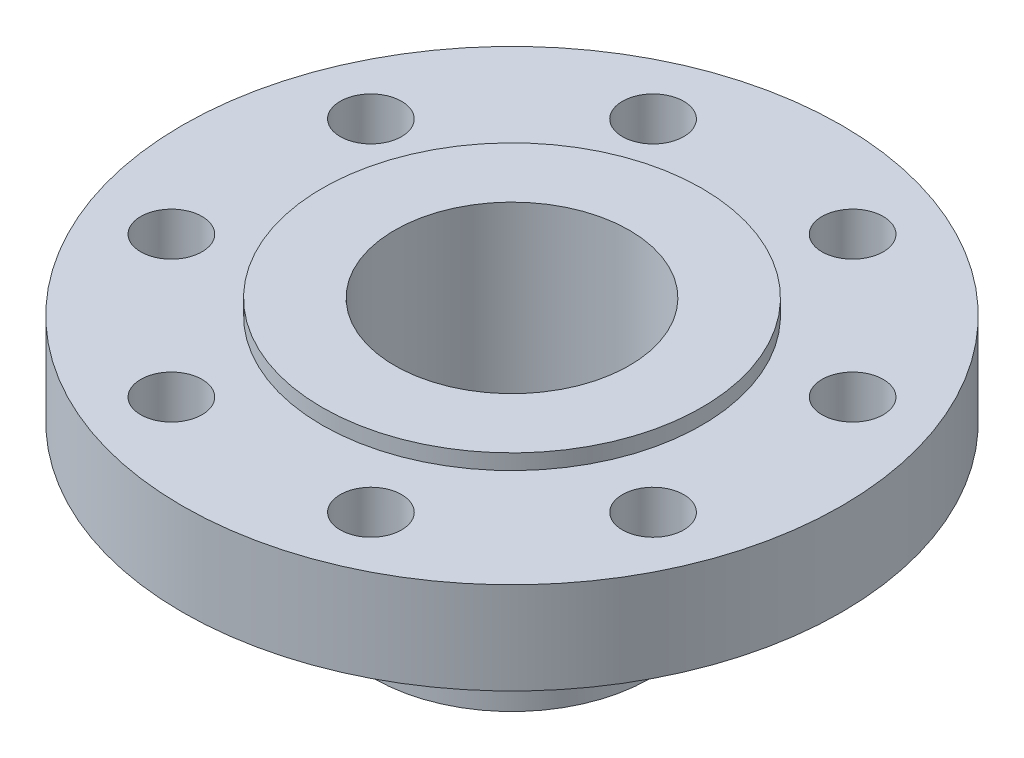
ISO-10303-21;
HEADER;
FILE_DESCRIPTION(('STEP AP214'),'2;1');
FILE_NAME('part.step','',(''),(''),'','','');
FILE_SCHEMA(('AUTOMOTIVE_DESIGN { 1 0 10303 214 1 1 1 1 }'));
ENDSEC;
DATA;
#1=APPLICATION_CONTEXT('core data for automotive mechanical design processes');
#2=APPLICATION_PROTOCOL_DEFINITION('international standard','automotive_design',2000,#1);
#3=PRODUCT_CONTEXT('',#1,'mechanical');
#4=PRODUCT('Part','Part','',(#3));
#5=PRODUCT_RELATED_PRODUCT_CATEGORY('part','',(#4));
#6=PRODUCT_DEFINITION_FORMATION('','',#4);
#7=PRODUCT_DEFINITION_CONTEXT('part definition',#1,'design');
#8=PRODUCT_DEFINITION('design','',#6,#7);
#9=PRODUCT_DEFINITION_SHAPE('','',#8);
#10=(LENGTH_UNIT() NAMED_UNIT(*) SI_UNIT(.MILLI.,.METRE.));
#11=(NAMED_UNIT(*) PLANE_ANGLE_UNIT() SI_UNIT($,.RADIAN.));
#12=(NAMED_UNIT(*) SI_UNIT($,.STERADIAN.) SOLID_ANGLE_UNIT());
#13=UNCERTAINTY_MEASURE_WITH_UNIT(LENGTH_MEASURE(1.E-05),#10,'distance_accuracy_value','');
#14=(GEOMETRIC_REPRESENTATION_CONTEXT(3) GLOBAL_UNCERTAINTY_ASSIGNED_CONTEXT((#13)) GLOBAL_UNIT_ASSIGNED_CONTEXT((#10,
#11,#12)) REPRESENTATION_CONTEXT('',''));
#15=CARTESIAN_POINT('',(0.,0.,0.));
#16=DIRECTION('',(0.,0.,1.));
#17=DIRECTION('',(1.,0.,0.));
#18=AXIS2_PLACEMENT_3D('',#15,#16,#17);
#19=CARTESIAN_POINT('',(57.15,0.,0.));
#20=DIRECTION('',(0.,-1.,0.));
#21=DIRECTION('',(0.,0.,-1.));
#22=AXIS2_PLACEMENT_3D('',#19,#20,#21);
#23=PLANE('',#22);
#24=CARTESIAN_POINT('',(0.,0.,0.));
#25=DIRECTION('',(0.,-1.,0.));
#26=DIRECTION('',(0.,0.,-1.));
#27=AXIS2_PLACEMENT_3D('',#24,#25,#26);
#28=CIRCLE('',#27,57.15);
#29=CARTESIAN_POINT('',(0.,0.,-57.15));
#30=VERTEX_POINT('',#29);
#31=EDGE_CURVE('E54',#30,#30,#28,.T.);
#32=ORIENTED_EDGE('',*,*,#31,.T.);
#33=EDGE_LOOP('',(#32));
#34=FACE_BOUND('',#33,.T.);
#35=CARTESIAN_POINT('',(0.,0.,0.));
#36=DIRECTION('',(0.,-1.,0.));
#37=DIRECTION('',(0.,0.,-1.));
#38=AXIS2_PLACEMENT_3D('',#35,#36,#37);
#39=CIRCLE('',#38,48.59);
#40=CARTESIAN_POINT('',(0.,0.,-48.59));
#41=VERTEX_POINT('',#40);
#42=EDGE_CURVE('E10',#41,#41,#39,.T.);
#43=ORIENTED_EDGE('',*,*,#42,.F.);
#44=EDGE_LOOP('',(#43));
#45=FACE_BOUND('',#44,.T.);
#46=ADVANCED_FACE('F35',(#34,#45),#23,.T.);
#47=CARTESIAN_POINT('',(0.,0.,0.));
#48=DIRECTION('',(0.,-1.,0.));
#49=DIRECTION('',(0.,0.,-1.));
#50=AXIS2_PLACEMENT_3D('',#47,#48,#49);
#51=CYLINDRICAL_SURFACE('',#50,48.59);
#52=ORIENTED_EDGE('',*,*,#42,.T.);
#53=EDGE_LOOP('',(#52));
#54=FACE_BOUND('',#53,.T.);
#55=CARTESIAN_POINT('',(0.,107.95,0.));
#56=DIRECTION('',(0.,-1.,0.));
#57=DIRECTION('',(0.,0.,-1.));
#58=AXIS2_PLACEMENT_3D('',#55,#56,#57);
#59=CIRCLE('',#58,48.59);
#60=CARTESIAN_POINT('',(0.,107.95,-48.59));
#61=VERTEX_POINT('',#60);
#62=EDGE_CURVE('E42',#61,#61,#59,.T.);
#63=ORIENTED_EDGE('',*,*,#62,.F.);
#64=EDGE_LOOP('',(#63));
#65=FACE_BOUND('',#64,.T.);
#66=ADVANCED_FACE('F109',(#54,#65),#51,.F.);
#67=CARTESIAN_POINT('',(48.59,107.95,0.));
#68=DIRECTION('',(0.,1.,0.));
#69=DIRECTION('',(0.,0.,1.));
#70=AXIS2_PLACEMENT_3D('',#67,#68,#69);
#71=PLANE('',#70);
#72=ORIENTED_EDGE('',*,*,#62,.T.);
#73=EDGE_LOOP('',(#72));
#74=FACE_BOUND('',#73,.T.);
#75=CARTESIAN_POINT('',(0.,107.95,0.));
#76=DIRECTION('',(0.,-1.,0.));
#77=DIRECTION('',(0.,0.,-1.));
#78=AXIS2_PLACEMENT_3D('',#75,#76,#77);
#79=CIRCLE('',#78,78.615);
#80=CARTESIAN_POINT('',(0.,107.95,-78.615));
#81=VERTEX_POINT('',#80);
#82=EDGE_CURVE('E47',#81,#81,#79,.T.);
#83=ORIENTED_EDGE('',*,*,#82,.F.);
#84=EDGE_LOOP('',(#83));
#85=FACE_BOUND('',#84,.T.);
#86=ADVANCED_FACE('F107',(#74,#85),#71,.T.);
#87=CARTESIAN_POINT('',(0.,0.,0.));
#88=DIRECTION('',(0.,-1.,0.));
#89=DIRECTION('',(0.,0.,-1.));
#90=AXIS2_PLACEMENT_3D('',#87,#88,#89);
#91=CYLINDRICAL_SURFACE('',#90,78.615);
#92=ORIENTED_EDGE('',*,*,#82,.T.);
#93=EDGE_LOOP('',(#92));
#94=FACE_BOUND('',#93,.T.);
#95=CARTESIAN_POINT('',(0.,101.6,0.));
#96=DIRECTION('',(0.,-1.,0.));
#97=DIRECTION('',(0.,0.,-1.));
#98=AXIS2_PLACEMENT_3D('',#95,#96,#97);
#99=CIRCLE('',#98,78.615);
#100=CARTESIAN_POINT('',(0.,101.6,-78.615));
#101=VERTEX_POINT('',#100);
#102=EDGE_CURVE('E99',#101,#101,#99,.T.);
#103=ORIENTED_EDGE('',*,*,#102,.F.);
#104=EDGE_LOOP('',(#103));
#105=FACE_BOUND('',#104,.T.);
#106=ADVANCED_FACE('F104',(#94,#105),#91,.T.);
#107=CARTESIAN_POINT('',(78.615,101.6,0.));
#108=DIRECTION('',(0.,1.,0.));
#109=DIRECTION('',(0.,0.,1.));
#110=AXIS2_PLACEMENT_3D('',#107,#108,#109);
#111=PLANE('',#110);
#112=CARTESIAN_POINT('',(-41.3106765238101,101.6,-99.7327955345939));
#113=DIRECTION('',(0.,1.,0.));
#114=DIRECTION('',(0.707106781186539,0.,0.707106781186556));
#115=AXIS2_PLACEMENT_3D('',#112,#113,#114);
#116=CIRCLE('',#115,12.7);
#117=CARTESIAN_POINT('',(-32.3304204027411,101.6,-90.7525394135247));
#118=VERTEX_POINT('',#117);
#119=EDGE_CURVE('E157',#118,#118,#116,.T.);
#120=ORIENTED_EDGE('',*,*,#119,.F.);
#121=EDGE_LOOP('',(#120));
#122=FACE_BOUND('',#121,.T.);
#123=CARTESIAN_POINT('',(-99.7327955345929,101.6,-41.3106765238126));
#124=DIRECTION('',(0.,1.,0.));
#125=DIRECTION('',(1.,0.,0.));
#126=AXIS2_PLACEMENT_3D('',#123,#124,#125);
#127=CIRCLE('',#126,12.7);
#128=CARTESIAN_POINT('',(-87.0327955345929,101.6,-41.3106765238124));
#129=VERTEX_POINT('',#128);
#130=EDGE_CURVE('E161',#129,#129,#127,.T.);
#131=ORIENTED_EDGE('',*,*,#130,.F.);
#132=EDGE_LOOP('',(#131));
#133=FACE_BOUND('',#132,.T.);
#134=CARTESIAN_POINT('',(-99.7327955345938,101.6,41.3106765238105));
#135=DIRECTION('',(0.,1.,0.));
#136=DIRECTION('',(0.707106781186554,0.,-0.707106781186541));
#137=AXIS2_PLACEMENT_3D('',#134,#135,#136);
#138=CIRCLE('',#137,12.7);
#139=CARTESIAN_POINT('',(-90.7525394135246,101.6,32.3304204027414));
#140=VERTEX_POINT('',#139);
#141=EDGE_CURVE('E165',#140,#140,#138,.T.);
#142=ORIENTED_EDGE('',*,*,#141,.F.);
#143=EDGE_LOOP('',(#142));
#144=FACE_BOUND('',#143,.T.);
#145=CARTESIAN_POINT('',(-41.3106765238115,101.6,99.7327955345934));
#146=DIRECTION('',(0.,1.,0.));
#147=DIRECTION('',(0.,0.,-1.));
#148=AXIS2_PLACEMENT_3D('',#145,#146,#147);
#149=CIRCLE('',#148,12.7);
#150=CARTESIAN_POINT('',(-41.3106765238115,101.6,87.0327955345933));
#151=VERTEX_POINT('',#150);
#152=EDGE_CURVE('E169',#151,#151,#149,.T.);
#153=ORIENTED_EDGE('',*,*,#152,.F.);
#154=EDGE_LOOP('',(#153));
#155=FACE_BOUND('',#154,.T.);
#156=CARTESIAN_POINT('',(41.3106765238108,101.6,99.7327955345936));
#157=DIRECTION('',(0.,1.,0.));
#158=DIRECTION('',(-0.707106781186544,0.,-0.707106781186551));
#159=AXIS2_PLACEMENT_3D('',#156,#157,#158);
#160=CIRCLE('',#159,12.7);
#161=CARTESIAN_POINT('',(32.3304204027417,101.6,90.7525394135244));
#162=VERTEX_POINT('',#161);
#163=EDGE_CURVE('E173',#162,#162,#160,.T.);
#164=ORIENTED_EDGE('',*,*,#163,.F.);
#165=EDGE_LOOP('',(#164));
#166=FACE_BOUND('',#165,.T.);
#167=CARTESIAN_POINT('',(99.7327955345932,101.6,41.3106765238119));
#168=DIRECTION('',(0.,1.,0.));
#169=DIRECTION('',(-1.,0.,0.));
#170=AXIS2_PLACEMENT_3D('',#167,#168,#169);
#171=CIRCLE('',#170,12.7);
#172=CARTESIAN_POINT('',(87.0327955345932,101.6,41.3106765238118));
#173=VERTEX_POINT('',#172);
#174=EDGE_CURVE('E177',#173,#173,#171,.T.);
#175=ORIENTED_EDGE('',*,*,#174,.F.);
#176=EDGE_LOOP('',(#175));
#177=FACE_BOUND('',#176,.T.);
#178=CARTESIAN_POINT('',(99.7327955345935,101.6,-41.3106765238112));
#179=DIRECTION('',(0.,1.,0.));
#180=DIRECTION('',(-0.707106781186549,0.,0.707106781186546));
#181=AXIS2_PLACEMENT_3D('',#178,#179,#180);
#182=CIRCLE('',#181,12.7);
#183=CARTESIAN_POINT('',(90.7525394135243,101.6,-32.330420402742));
#184=VERTEX_POINT('',#183);
#185=EDGE_CURVE('E60',#184,#184,#182,.T.);
#186=ORIENTED_EDGE('',*,*,#185,.F.);
#187=EDGE_LOOP('',(#186));
#188=FACE_BOUND('',#187,.T.);
#189=CARTESIAN_POINT('',(41.3106765238115,101.6,-99.7327955345934));
#190=DIRECTION('',(0.,1.,0.));
#191=DIRECTION('',(0.,0.,1.));
#192=AXIS2_PLACEMENT_3D('',#189,#190,#191);
#193=CIRCLE('',#192,12.7);
#194=CARTESIAN_POINT('',(41.3106765238115,101.6,-87.0327955345933));
#195=VERTEX_POINT('',#194);
#196=EDGE_CURVE('E55',#195,#195,#193,.T.);
#197=ORIENTED_EDGE('',*,*,#196,.F.);
#198=EDGE_LOOP('',(#197));
#199=FACE_BOUND('',#198,.T.);
#200=ORIENTED_EDGE('',*,*,#102,.T.);
#201=EDGE_LOOP('',(#200));
#202=FACE_BOUND('',#201,.T.);
#203=CARTESIAN_POINT('',(0.,101.6,0.));
#204=DIRECTION('',(0.,-1.,0.));
#205=DIRECTION('',(0.,0.,-1.));
#206=AXIS2_PLACEMENT_3D('',#203,#204,#205);
#207=CIRCLE('',#206,136.525);
#208=CARTESIAN_POINT('',(0.,101.6,-136.525));
#209=VERTEX_POINT('',#208);
#210=EDGE_CURVE('E96',#209,#209,#207,.T.);
#211=ORIENTED_EDGE('',*,*,#210,.F.);
#212=EDGE_LOOP('',(#211));
#213=FACE_BOUND('',#212,.T.);
#214=ADVANCED_FACE('F116',(#122,#133,#144,#155,#166,#177,#188,#199,#202,#213),#111,.T.);
#215=CARTESIAN_POINT('',(0.,0.,0.));
#216=DIRECTION('',(0.,-1.,0.));
#217=DIRECTION('',(0.,0.,-1.));
#218=AXIS2_PLACEMENT_3D('',#215,#216,#217);
#219=CYLINDRICAL_SURFACE('',#218,136.525);
#220=ORIENTED_EDGE('',*,*,#210,.T.);
#221=EDGE_LOOP('',(#220));
#222=FACE_BOUND('',#221,.T.);
#223=CARTESIAN_POINT('',(0.,63.5,0.));
#224=DIRECTION('',(0.,-1.,0.));
#225=DIRECTION('',(0.,0.,-1.));
#226=AXIS2_PLACEMENT_3D('',#223,#224,#225);
#227=CIRCLE('',#226,136.525);
#228=CARTESIAN_POINT('',(0.,63.5,-136.525));
#229=VERTEX_POINT('',#228);
#230=EDGE_CURVE('E93',#229,#229,#227,.T.);
#231=ORIENTED_EDGE('',*,*,#230,.F.);
#232=EDGE_LOOP('',(#231));
#233=FACE_BOUND('',#232,.T.);
#234=ADVANCED_FACE('F145',(#222,#233),#219,.T.);
#235=CARTESIAN_POINT('',(136.525,63.5,0.));
#236=DIRECTION('',(0.,-1.,0.));
#237=DIRECTION('',(0.,0.,-1.));
#238=AXIS2_PLACEMENT_3D('',#235,#236,#237);
#239=PLANE('',#238);
#240=CARTESIAN_POINT('',(-41.3106765238101,63.5,-99.7327955345939));
#241=DIRECTION('',(0.,-1.,0.));
#242=DIRECTION('',(0.,0.,-1.));
#243=AXIS2_PLACEMENT_3D('',#240,#241,#242);
#244=CIRCLE('',#243,12.7);
#245=CARTESIAN_POINT('',(-41.3106765238101,63.5,-112.432795534594));
#246=VERTEX_POINT('',#245);
#247=EDGE_CURVE('E38',#246,#246,#244,.T.);
#248=ORIENTED_EDGE('',*,*,#247,.F.);
#249=EDGE_LOOP('',(#248));
#250=FACE_BOUND('',#249,.T.);
#251=CARTESIAN_POINT('',(-99.7327955345929,63.5,-41.3106765238126));
#252=DIRECTION('',(0.,-1.,0.));
#253=DIRECTION('',(0.,0.,-1.));
#254=AXIS2_PLACEMENT_3D('',#251,#252,#253);
#255=CIRCLE('',#254,12.7);
#256=CARTESIAN_POINT('',(-99.7327955345929,63.5,-54.0106765238126));
#257=VERTEX_POINT('',#256);
#258=EDGE_CURVE('E71',#257,#257,#255,.T.);
#259=ORIENTED_EDGE('',*,*,#258,.F.);
#260=EDGE_LOOP('',(#259));
#261=FACE_BOUND('',#260,.T.);
#262=CARTESIAN_POINT('',(-99.7327955345938,63.5,41.3106765238105));
#263=DIRECTION('',(0.,-1.,0.));
#264=DIRECTION('',(0.,0.,-1.));
#265=AXIS2_PLACEMENT_3D('',#262,#263,#264);
#266=CIRCLE('',#265,12.7);
#267=CARTESIAN_POINT('',(-99.7327955345938,63.5,28.6106765238105));
#268=VERTEX_POINT('',#267);
#269=EDGE_CURVE('E69',#268,#268,#266,.T.);
#270=ORIENTED_EDGE('',*,*,#269,.F.);
#271=EDGE_LOOP('',(#270));
#272=FACE_BOUND('',#271,.T.);
#273=CARTESIAN_POINT('',(-41.3106765238115,63.5,99.7327955345934));
#274=DIRECTION('',(0.,-1.,0.));
#275=DIRECTION('',(0.,0.,-1.));
#276=AXIS2_PLACEMENT_3D('',#273,#274,#275);
#277=CIRCLE('',#276,12.7);
#278=CARTESIAN_POINT('',(-41.3106765238115,63.5,87.0327955345933));
#279=VERTEX_POINT('',#278);
#280=EDGE_CURVE('E66',#279,#279,#277,.T.);
#281=ORIENTED_EDGE('',*,*,#280,.F.);
#282=EDGE_LOOP('',(#281));
#283=FACE_BOUND('',#282,.T.);
#284=CARTESIAN_POINT('',(41.3106765238108,63.5,99.7327955345936));
#285=DIRECTION('',(0.,-1.,0.));
#286=DIRECTION('',(0.,0.,-1.));
#287=AXIS2_PLACEMENT_3D('',#284,#285,#286);
#288=CIRCLE('',#287,12.7);
#289=CARTESIAN_POINT('',(41.3106765238108,63.5,87.0327955345936));
#290=VERTEX_POINT('',#289);
#291=EDGE_CURVE('E63',#290,#290,#288,.T.);
#292=ORIENTED_EDGE('',*,*,#291,.F.);
#293=EDGE_LOOP('',(#292));
#294=FACE_BOUND('',#293,.T.);
#295=CARTESIAN_POINT('',(99.7327955345932,63.5,41.3106765238119));
#296=DIRECTION('',(0.,-1.,0.));
#297=DIRECTION('',(0.,0.,-1.));
#298=AXIS2_PLACEMENT_3D('',#295,#296,#297);
#299=CIRCLE('',#298,12.7);
#300=CARTESIAN_POINT('',(99.7327955345932,63.5,28.6106765238119));
#301=VERTEX_POINT('',#300);
#302=EDGE_CURVE('E59',#301,#301,#299,.T.);
#303=ORIENTED_EDGE('',*,*,#302,.F.);
#304=EDGE_LOOP('',(#303));
#305=FACE_BOUND('',#304,.T.);
#306=CARTESIAN_POINT('',(99.7327955345935,63.5,-41.3106765238112));
#307=DIRECTION('',(0.,-1.,0.));
#308=DIRECTION('',(0.,0.,-1.));
#309=AXIS2_PLACEMENT_3D('',#306,#307,#308);
#310=CIRCLE('',#309,12.7);
#311=CARTESIAN_POINT('',(99.7327955345935,63.5,-54.0106765238112));
#312=VERTEX_POINT('',#311);
#313=EDGE_CURVE('E56',#312,#312,#310,.T.);
#314=ORIENTED_EDGE('',*,*,#313,.F.);
#315=EDGE_LOOP('',(#314));
#316=FACE_BOUND('',#315,.T.);
#317=CARTESIAN_POINT('',(41.3106765238115,63.5,-99.7327955345934));
#318=DIRECTION('',(0.,-1.,0.));
#319=DIRECTION('',(0.,0.,-1.));
#320=AXIS2_PLACEMENT_3D('',#317,#318,#319);
#321=CIRCLE('',#320,12.7);
#322=CARTESIAN_POINT('',(41.3106765238115,63.5,-112.432795534593));
#323=VERTEX_POINT('',#322);
#324=EDGE_CURVE('E51',#323,#323,#321,.T.);
#325=ORIENTED_EDGE('',*,*,#324,.F.);
#326=EDGE_LOOP('',(#325));
#327=FACE_BOUND('',#326,.T.);
#328=ORIENTED_EDGE('',*,*,#230,.T.);
#329=EDGE_LOOP('',(#328));
#330=FACE_BOUND('',#329,.T.);
#331=CARTESIAN_POINT('',(0.,63.5,0.));
#332=DIRECTION('',(0.,-1.,0.));
#333=DIRECTION('',(0.,0.,-1.));
#334=AXIS2_PLACEMENT_3D('',#331,#332,#333);
#335=CIRCLE('',#334,76.2);
#336=CARTESIAN_POINT('',(0.,63.5,-76.2));
#337=VERTEX_POINT('',#336);
#338=EDGE_CURVE('E90',#337,#337,#335,.T.);
#339=ORIENTED_EDGE('',*,*,#338,.F.);
#340=EDGE_LOOP('',(#339));
#341=FACE_BOUND('',#340,.T.);
#342=ADVANCED_FACE('F138',(#250,#261,#272,#283,#294,#305,#316,#327,#330,#341),#239,.T.);
#343=CARTESIAN_POINT('',(0.,12.29,0.));
#344=DIRECTION('',(0.,1.,0.));
#345=DIRECTION('',(0.,0.,1.));
#346=AXIS2_PLACEMENT_3D('',#343,#344,#345);
#347=CONICAL_SURFACE('',#346,57.15,0.356135884259093);
#348=ORIENTED_EDGE('',*,*,#338,.T.);
#349=EDGE_LOOP('',(#348));
#350=FACE_BOUND('',#349,.T.);
#351=CARTESIAN_POINT('',(0.,12.29,0.));
#352=DIRECTION('',(0.,-1.,0.));
#353=DIRECTION('',(0.,0.,-1.));
#354=AXIS2_PLACEMENT_3D('',#351,#352,#353);
#355=CIRCLE('',#354,57.15);
#356=CARTESIAN_POINT('',(0.,12.29,-57.15));
#357=VERTEX_POINT('',#356);
#358=EDGE_CURVE('E87',#357,#357,#355,.T.);
#359=ORIENTED_EDGE('',*,*,#358,.F.);
#360=EDGE_LOOP('',(#359));
#361=FACE_BOUND('',#360,.T.);
#362=ADVANCED_FACE('F128',(#350,#361),#347,.T.);
#363=CARTESIAN_POINT('',(0.,0.,0.));
#364=DIRECTION('',(0.,-1.,0.));
#365=DIRECTION('',(0.,0.,-1.));
#366=AXIS2_PLACEMENT_3D('',#363,#364,#365);
#367=CYLINDRICAL_SURFACE('',#366,57.15);
#368=ORIENTED_EDGE('',*,*,#358,.T.);
#369=EDGE_LOOP('',(#368));
#370=FACE_BOUND('',#369,.T.);
#371=ORIENTED_EDGE('',*,*,#31,.F.);
#372=EDGE_LOOP('',(#371));
#373=FACE_BOUND('',#372,.T.);
#374=ADVANCED_FACE('F125',(#370,#373),#367,.T.);
#375=CARTESIAN_POINT('',(41.3106765238115,0.,-99.7327955345934));
#376=DIRECTION('',(0.,1.,0.));
#377=DIRECTION('',(0.,0.,1.));
#378=AXIS2_PLACEMENT_3D('',#375,#376,#377);
#379=CYLINDRICAL_SURFACE('',#378,12.7);
#380=ORIENTED_EDGE('',*,*,#324,.T.);
#381=EDGE_LOOP('',(#380));
#382=FACE_BOUND('',#381,.T.);
#383=ORIENTED_EDGE('',*,*,#196,.T.);
#384=EDGE_LOOP('',(#383));
#385=FACE_BOUND('',#384,.T.);
#386=ADVANCED_FACE('F127',(#382,#385),#379,.F.);
#387=CARTESIAN_POINT('',(99.7327955345935,0.,-41.3106765238112));
#388=DIRECTION('',(0.,1.,0.));
#389=DIRECTION('',(0.,0.,1.));
#390=AXIS2_PLACEMENT_3D('',#387,#388,#389);
#391=CYLINDRICAL_SURFACE('',#390,12.7);
#392=ORIENTED_EDGE('',*,*,#313,.T.);
#393=EDGE_LOOP('',(#392));
#394=FACE_BOUND('',#393,.T.);
#395=ORIENTED_EDGE('',*,*,#185,.T.);
#396=EDGE_LOOP('',(#395));
#397=FACE_BOUND('',#396,.T.);
#398=ADVANCED_FACE('F135',(#394,#397),#391,.F.);
#399=CARTESIAN_POINT('',(99.7327955345932,0.,41.3106765238119));
#400=DIRECTION('',(0.,1.,0.));
#401=DIRECTION('',(0.,0.,1.));
#402=AXIS2_PLACEMENT_3D('',#399,#400,#401);
#403=CYLINDRICAL_SURFACE('',#402,12.7);
#404=ORIENTED_EDGE('',*,*,#302,.T.);
#405=EDGE_LOOP('',(#404));
#406=FACE_BOUND('',#405,.T.);
#407=ORIENTED_EDGE('',*,*,#174,.T.);
#408=EDGE_LOOP('',(#407));
#409=FACE_BOUND('',#408,.T.);
#410=ADVANCED_FACE('F211',(#406,#409),#403,.F.);
#411=CARTESIAN_POINT('',(41.3106765238108,0.,99.7327955345936));
#412=DIRECTION('',(0.,1.,0.));
#413=DIRECTION('',(0.,0.,1.));
#414=AXIS2_PLACEMENT_3D('',#411,#412,#413);
#415=CYLINDRICAL_SURFACE('',#414,12.7);
#416=ORIENTED_EDGE('',*,*,#291,.T.);
#417=EDGE_LOOP('',(#416));
#418=FACE_BOUND('',#417,.T.);
#419=ORIENTED_EDGE('',*,*,#163,.T.);
#420=EDGE_LOOP('',(#419));
#421=FACE_BOUND('',#420,.T.);
#422=ADVANCED_FACE('F216',(#418,#421),#415,.F.);
#423=CARTESIAN_POINT('',(-41.3106765238115,0.,99.7327955345934));
#424=DIRECTION('',(0.,1.,0.));
#425=DIRECTION('',(0.,0.,1.));
#426=AXIS2_PLACEMENT_3D('',#423,#424,#425);
#427=CYLINDRICAL_SURFACE('',#426,12.7);
#428=ORIENTED_EDGE('',*,*,#280,.T.);
#429=EDGE_LOOP('',(#428));
#430=FACE_BOUND('',#429,.T.);
#431=ORIENTED_EDGE('',*,*,#152,.T.);
#432=EDGE_LOOP('',(#431));
#433=FACE_BOUND('',#432,.T.);
#434=ADVANCED_FACE('F226',(#430,#433),#427,.F.);
#435=CARTESIAN_POINT('',(-99.7327955345938,0.,41.3106765238105));
#436=DIRECTION('',(0.,1.,0.));
#437=DIRECTION('',(0.,0.,1.));
#438=AXIS2_PLACEMENT_3D('',#435,#436,#437);
#439=CYLINDRICAL_SURFACE('',#438,12.7);
#440=ORIENTED_EDGE('',*,*,#269,.T.);
#441=EDGE_LOOP('',(#440));
#442=FACE_BOUND('',#441,.T.);
#443=ORIENTED_EDGE('',*,*,#141,.T.);
#444=EDGE_LOOP('',(#443));
#445=FACE_BOUND('',#444,.T.);
#446=ADVANCED_FACE('F207',(#442,#445),#439,.F.);
#447=CARTESIAN_POINT('',(-99.7327955345929,0.,-41.3106765238126));
#448=DIRECTION('',(0.,1.,0.));
#449=DIRECTION('',(0.,0.,1.));
#450=AXIS2_PLACEMENT_3D('',#447,#448,#449);
#451=CYLINDRICAL_SURFACE('',#450,12.7);
#452=ORIENTED_EDGE('',*,*,#258,.T.);
#453=EDGE_LOOP('',(#452));
#454=FACE_BOUND('',#453,.T.);
#455=ORIENTED_EDGE('',*,*,#130,.T.);
#456=EDGE_LOOP('',(#455));
#457=FACE_BOUND('',#456,.T.);
#458=ADVANCED_FACE('F202',(#454,#457),#451,.F.);
#459=CARTESIAN_POINT('',(-41.3106765238101,0.,-99.7327955345939));
#460=DIRECTION('',(0.,1.,0.));
#461=DIRECTION('',(0.,0.,1.));
#462=AXIS2_PLACEMENT_3D('',#459,#460,#461);
#463=CYLINDRICAL_SURFACE('',#462,12.7);
#464=ORIENTED_EDGE('',*,*,#247,.T.);
#465=EDGE_LOOP('',(#464));
#466=FACE_BOUND('',#465,.T.);
#467=ORIENTED_EDGE('',*,*,#119,.T.);
#468=EDGE_LOOP('',(#467));
#469=FACE_BOUND('',#468,.T.);
#470=ADVANCED_FACE('F200',(#466,#469),#463,.F.);
#471=CLOSED_SHELL('',(#46,#66,#86,#106,#214,#234,#342,#362,#374,#386,#398,#410,#422,#434,#446,
#458,#470));
#472=MANIFOLD_SOLID_BREP('B2',#471);
#473=ADVANCED_BREP_SHAPE_REPRESENTATION('',(#18,#472),#14);
#474=SHAPE_DEFINITION_REPRESENTATION(#9,#473);
ENDSEC;
END-ISO-10303-21;
